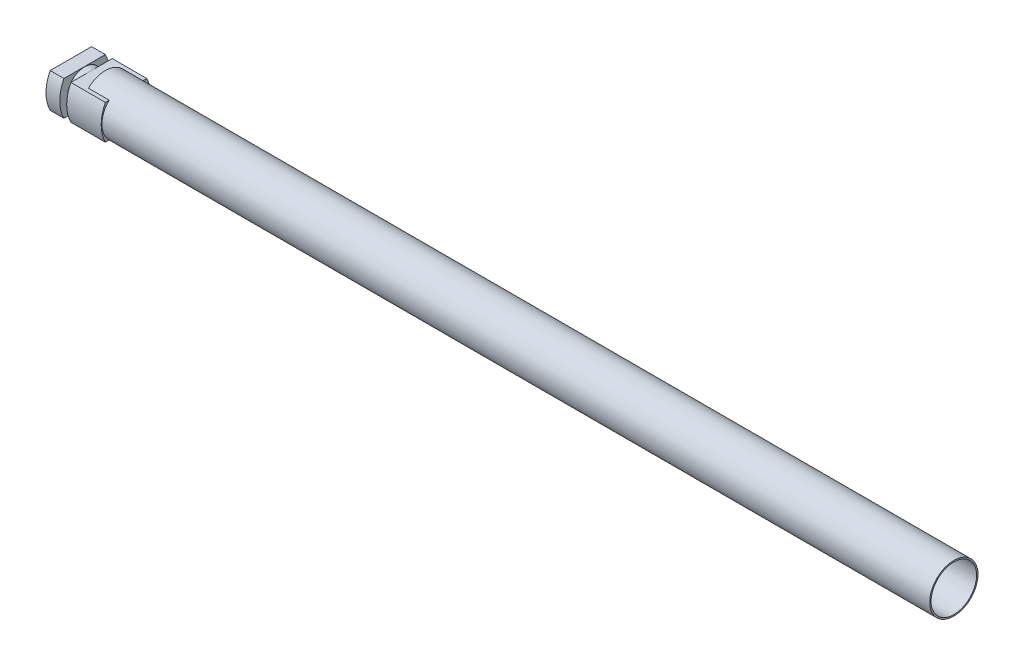
ISO-10303-21;
HEADER;
FILE_DESCRIPTION(('STEP AP214'),'2;1');
FILE_NAME('part.step','',(''),(''),'','','');
FILE_SCHEMA(('AUTOMOTIVE_DESIGN { 1 0 10303 214 1 1 1 1 }'));
ENDSEC;
DATA;
#1=APPLICATION_CONTEXT('core data for automotive mechanical design processes');
#2=APPLICATION_PROTOCOL_DEFINITION('international standard','automotive_design',2000,#1);
#3=PRODUCT_CONTEXT('',#1,'mechanical');
#4=PRODUCT('Part','Part','',(#3));
#5=PRODUCT_RELATED_PRODUCT_CATEGORY('part','',(#4));
#6=PRODUCT_DEFINITION_FORMATION('','',#4);
#7=PRODUCT_DEFINITION_CONTEXT('part definition',#1,'design');
#8=PRODUCT_DEFINITION('design','',#6,#7);
#9=PRODUCT_DEFINITION_SHAPE('','',#8);
#10=(LENGTH_UNIT() NAMED_UNIT(*) SI_UNIT(.MILLI.,.METRE.));
#11=(NAMED_UNIT(*) PLANE_ANGLE_UNIT() SI_UNIT($,.RADIAN.));
#12=(NAMED_UNIT(*) SI_UNIT($,.STERADIAN.) SOLID_ANGLE_UNIT());
#13=UNCERTAINTY_MEASURE_WITH_UNIT(LENGTH_MEASURE(1.E-05),#10,'distance_accuracy_value','');
#14=(GEOMETRIC_REPRESENTATION_CONTEXT(3) GLOBAL_UNCERTAINTY_ASSIGNED_CONTEXT((#13)) GLOBAL_UNIT_ASSIGNED_CONTEXT((#10,
#11,#12)) REPRESENTATION_CONTEXT('',''));
#15=CARTESIAN_POINT('',(0.,0.,0.));
#16=DIRECTION('',(0.,0.,1.));
#17=DIRECTION('',(1.,0.,0.));
#18=AXIS2_PLACEMENT_3D('',#15,#16,#17);
#19=CARTESIAN_POINT('',(101.6,0.,-23.831742394349));
#20=DIRECTION('',(-1.,0.,0.));
#21=DIRECTION('',(0.,0.,1.));
#22=AXIS2_PLACEMENT_3D('',#19,#20,#21);
#23=PLANE('',#22);
#24=DIRECTION('',(0.,0.,1.));
#25=VECTOR('',#24,1.);
#26=CARTESIAN_POINT('',(101.6,31.75,38.1));
#27=LINE('',#26,#25);
#28=CARTESIAN_POINT('',(101.6,31.75,-27.3566372202433));
#29=VERTEX_POINT('',#28);
#30=CARTESIAN_POINT('',(101.6,31.75,27.3566372202433));
#31=VERTEX_POINT('',#30);
#32=EDGE_CURVE('E143',#29,#31,#27,.T.);
#33=ORIENTED_EDGE('',*,*,#32,.T.);
#34=CARTESIAN_POINT('',(101.6,0.,0.));
#35=DIRECTION('',(1.,0.,0.));
#36=DIRECTION('',(0.,0.,-1.));
#37=AXIS2_PLACEMENT_3D('',#34,#35,#36);
#38=CIRCLE('',#37,41.91);
#39=CARTESIAN_POINT('',(101.6,-31.75,27.3566372202433));
#40=VERTEX_POINT('',#39);
#41=EDGE_CURVE('E145',#31,#40,#38,.T.);
#42=ORIENTED_EDGE('',*,*,#41,.T.);
#43=DIRECTION('',(0.,0.,-1.));
#44=VECTOR('',#43,1.);
#45=CARTESIAN_POINT('',(101.6,-31.75,-38.1));
#46=LINE('',#45,#44);
#47=CARTESIAN_POINT('',(101.6,-31.75,-27.3566372202433));
#48=VERTEX_POINT('',#47);
#49=EDGE_CURVE('E219',#40,#48,#46,.T.);
#50=ORIENTED_EDGE('',*,*,#49,.T.);
#51=EDGE_CURVE('E148',#48,#29,#38,.T.);
#52=ORIENTED_EDGE('',*,*,#51,.T.);
#53=EDGE_LOOP('',(#33,#42,#50,#52));
#54=FACE_BOUND('',#53,.T.);
#55=ADVANCED_FACE('F33',(#54),#23,.F.);
#56=CARTESIAN_POINT('',(101.6,0.,0.));
#57=DIRECTION('',(1.,0.,0.));
#58=DIRECTION('',(0.,0.,-1.));
#59=AXIS2_PLACEMENT_3D('',#56,#57,#58);
#60=CIRCLE('',#59,44.45);
#61=CARTESIAN_POINT('',(101.6,31.75,31.1085197333463));
#62=VERTEX_POINT('',#61);
#63=CARTESIAN_POINT('',(101.6,-31.75,31.1085197333463));
#64=VERTEX_POINT('',#63);
#65=EDGE_CURVE('E189',#62,#64,#60,.T.);
#66=ORIENTED_EDGE('',*,*,#65,.F.);
#67=CARTESIAN_POINT('',(101.6,31.75,38.1));
#68=VERTEX_POINT('',#67);
#69=EDGE_CURVE('E151',#62,#68,#27,.T.);
#70=ORIENTED_EDGE('',*,*,#69,.T.);
#71=CARTESIAN_POINT('',(101.6,0.,-23.831742394349));
#72=DIRECTION('',(1.,0.,0.));
#73=DIRECTION('',(0.,0.,1.));
#74=AXIS2_PLACEMENT_3D('',#71,#72,#73);
#75=CIRCLE('',#74,69.596);
#76=CARTESIAN_POINT('',(101.6,-31.75,38.1));
#77=VERTEX_POINT('',#76);
#78=EDGE_CURVE('E210',#68,#77,#75,.T.);
#79=ORIENTED_EDGE('',*,*,#78,.T.);
#80=EDGE_CURVE('E215',#77,#64,#46,.T.);
#81=ORIENTED_EDGE('',*,*,#80,.T.);
#82=EDGE_LOOP('',(#66,#70,#79,#81));
#83=FACE_BOUND('',#82,.T.);
#84=ADVANCED_FACE('F285',(#83),#23,.F.);
#85=CARTESIAN_POINT('',(101.6,0.,-23.831742394349));
#86=DIRECTION('',(-1.,0.,0.));
#87=DIRECTION('',(0.,0.,1.));
#88=AXIS2_PLACEMENT_3D('',#85,#86,#87);
#89=CYLINDRICAL_SURFACE('',#88,69.596);
#90=CARTESIAN_POINT('',(25.4,0.,-23.831742394349));
#91=DIRECTION('',(1.,0.,0.));
#92=DIRECTION('',(0.,0.,-1.));
#93=AXIS2_PLACEMENT_3D('',#90,#91,#92);
#94=CIRCLE('',#93,69.596);
#95=CARTESIAN_POINT('',(25.4,31.75,38.1));
#96=VERTEX_POINT('',#95);
#97=CARTESIAN_POINT('',(25.4,-31.75,38.1));
#98=VERTEX_POINT('',#97);
#99=EDGE_CURVE('E207',#96,#98,#94,.T.);
#100=ORIENTED_EDGE('',*,*,#99,.F.);
#101=DIRECTION('',(-1.,0.,0.));
#102=VECTOR('',#101,1.);
#103=CARTESIAN_POINT('',(101.6,31.75,38.1));
#104=LINE('',#103,#102);
#105=CARTESIAN_POINT('',(0.,31.75,38.1));
#106=VERTEX_POINT('',#105);
#107=EDGE_CURVE('E222',#96,#106,#104,.T.);
#108=ORIENTED_EDGE('',*,*,#107,.T.);
#109=CARTESIAN_POINT('',(0.,0.,-23.831742394349));
#110=DIRECTION('',(1.,0.,0.));
#111=DIRECTION('',(0.,0.,1.));
#112=AXIS2_PLACEMENT_3D('',#109,#110,#111);
#113=CIRCLE('',#112,69.596);
#114=CARTESIAN_POINT('',(0.,-31.75,38.1));
#115=VERTEX_POINT('',#114);
#116=EDGE_CURVE('E209',#106,#115,#113,.T.);
#117=ORIENTED_EDGE('',*,*,#116,.T.);
#118=DIRECTION('',(-1.,0.,0.));
#119=VECTOR('',#118,1.);
#120=CARTESIAN_POINT('',(101.6,-31.75,38.1));
#121=LINE('',#120,#119);
#122=EDGE_CURVE('E244',#98,#115,#121,.T.);
#123=ORIENTED_EDGE('',*,*,#122,.F.);
#124=EDGE_LOOP('',(#100,#108,#117,#123));
#125=FACE_BOUND('',#124,.T.);
#126=ADVANCED_FACE('F35',(#125),#89,.T.);
#127=CARTESIAN_POINT('',(101.6,-31.75,-38.1));
#128=DIRECTION('',(0.,1.,0.));
#129=DIRECTION('',(0.,0.,1.));
#130=AXIS2_PLACEMENT_3D('',#127,#128,#129);
#131=PLANE('',#130);
#132=DIRECTION('',(0.,0.,-1.));
#133=VECTOR('',#132,1.);
#134=CARTESIAN_POINT('',(25.4,-31.75,-38.1));
#135=LINE('',#134,#133);
#136=CARTESIAN_POINT('',(25.4,-31.75,-38.1));
#137=VERTEX_POINT('',#136);
#138=EDGE_CURVE('E205',#98,#137,#135,.T.);
#139=ORIENTED_EDGE('',*,*,#138,.F.);
#140=ORIENTED_EDGE('',*,*,#122,.T.);
#141=DIRECTION('',(0.,0.,-1.));
#142=VECTOR('',#141,1.);
#143=CARTESIAN_POINT('',(0.,-31.75,-38.1));
#144=LINE('',#143,#142);
#145=CARTESIAN_POINT('',(0.,-31.75,-38.1));
#146=VERTEX_POINT('',#145);
#147=EDGE_CURVE('E225',#115,#146,#144,.T.);
#148=ORIENTED_EDGE('',*,*,#147,.T.);
#149=DIRECTION('',(-1.,0.,0.));
#150=VECTOR('',#149,1.);
#151=CARTESIAN_POINT('',(101.6,-31.75,-38.1));
#152=LINE('',#151,#150);
#153=EDGE_CURVE('E240',#137,#146,#152,.T.);
#154=ORIENTED_EDGE('',*,*,#153,.F.);
#155=EDGE_LOOP('',(#139,#140,#148,#154));
#156=FACE_BOUND('',#155,.T.);
#157=ADVANCED_FACE('F270',(#156),#131,.F.);
#158=CARTESIAN_POINT('',(101.6,0.,23.831742394349));
#159=DIRECTION('',(-1.,0.,0.));
#160=DIRECTION('',(0.,0.,1.));
#161=AXIS2_PLACEMENT_3D('',#158,#159,#160);
#162=CYLINDRICAL_SURFACE('',#161,69.596);
#163=CARTESIAN_POINT('',(25.4,0.,23.831742394349));
#164=DIRECTION('',(1.,0.,0.));
#165=DIRECTION('',(0.,0.,-1.));
#166=AXIS2_PLACEMENT_3D('',#163,#164,#165);
#167=CIRCLE('',#166,69.596);
#168=CARTESIAN_POINT('',(25.4,31.75,-38.1));
#169=VERTEX_POINT('',#168);
#170=EDGE_CURVE('E203',#137,#169,#167,.T.);
#171=ORIENTED_EDGE('',*,*,#170,.F.);
#172=ORIENTED_EDGE('',*,*,#153,.T.);
#173=CARTESIAN_POINT('',(0.,0.,23.831742394349));
#174=DIRECTION('',(1.,0.,0.));
#175=DIRECTION('',(0.,0.,1.));
#176=AXIS2_PLACEMENT_3D('',#173,#174,#175);
#177=CIRCLE('',#176,69.596);
#178=CARTESIAN_POINT('',(0.,31.75,-38.1));
#179=VERTEX_POINT('',#178);
#180=EDGE_CURVE('E228',#146,#179,#177,.T.);
#181=ORIENTED_EDGE('',*,*,#180,.T.);
#182=DIRECTION('',(-1.,0.,0.));
#183=VECTOR('',#182,1.);
#184=CARTESIAN_POINT('',(101.6,31.75,-38.1));
#185=LINE('',#184,#183);
#186=EDGE_CURVE('E236',#169,#179,#185,.T.);
#187=ORIENTED_EDGE('',*,*,#186,.F.);
#188=EDGE_LOOP('',(#171,#172,#181,#187));
#189=FACE_BOUND('',#188,.T.);
#190=ADVANCED_FACE('F272',(#189),#162,.T.);
#191=CARTESIAN_POINT('',(101.6,31.75,38.1));
#192=DIRECTION('',(0.,-1.,0.));
#193=DIRECTION('',(0.,0.,-1.));
#194=AXIS2_PLACEMENT_3D('',#191,#192,#193);
#195=PLANE('',#194);
#196=DIRECTION('',(0.,0.,1.));
#197=VECTOR('',#196,1.);
#198=CARTESIAN_POINT('',(25.4,31.75,38.1));
#199=LINE('',#198,#197);
#200=EDGE_CURVE('E249',#169,#96,#199,.T.);
#201=ORIENTED_EDGE('',*,*,#200,.F.);
#202=ORIENTED_EDGE('',*,*,#186,.T.);
#203=DIRECTION('',(0.,0.,1.));
#204=VECTOR('',#203,1.);
#205=CARTESIAN_POINT('',(0.,31.75,38.1));
#206=LINE('',#205,#204);
#207=EDGE_CURVE('E214',#179,#106,#206,.T.);
#208=ORIENTED_EDGE('',*,*,#207,.T.);
#209=ORIENTED_EDGE('',*,*,#107,.F.);
#210=EDGE_LOOP('',(#201,#202,#208,#209));
#211=FACE_BOUND('',#210,.T.);
#212=ADVANCED_FACE('F261',(#211),#195,.F.);
#213=CARTESIAN_POINT('',(0.,0.,-23.831742394349));
#214=DIRECTION('',(-1.,0.,0.));
#215=DIRECTION('',(0.,0.,1.));
#216=AXIS2_PLACEMENT_3D('',#213,#214,#215);
#217=PLANE('',#216);
#218=ORIENTED_EDGE('',*,*,#116,.F.);
#219=ORIENTED_EDGE('',*,*,#207,.F.);
#220=ORIENTED_EDGE('',*,*,#180,.F.);
#221=ORIENTED_EDGE('',*,*,#147,.F.);
#222=EDGE_LOOP('',(#218,#219,#220,#221));
#223=FACE_BOUND('',#222,.T.);
#224=ADVANCED_FACE('F267',(#223),#217,.T.);
#225=CARTESIAN_POINT('',(25.4,31.334385241102,0.));
#226=DIRECTION('',(1.,0.,0.));
#227=DIRECTION('',(0.,0.,-1.));
#228=AXIS2_PLACEMENT_3D('',#225,#226,#227);
#229=PLANE('',#228);
#230=CARTESIAN_POINT('',(25.4,0.,0.));
#231=DIRECTION('',(-1.,0.,0.));
#232=DIRECTION('',(0.,0.,1.));
#233=AXIS2_PLACEMENT_3D('',#230,#231,#232);
#234=CIRCLE('',#233,31.334385241102);
#235=CARTESIAN_POINT('',(25.4,0.,31.334385241102));
#236=VERTEX_POINT('',#235);
#237=EDGE_CURVE('E188',#236,#236,#234,.T.);
#238=ORIENTED_EDGE('',*,*,#237,.T.);
#239=EDGE_LOOP('',(#238));
#240=FACE_BOUND('',#239,.T.);
#241=ORIENTED_EDGE('',*,*,#99,.T.);
#242=ORIENTED_EDGE('',*,*,#138,.T.);
#243=ORIENTED_EDGE('',*,*,#170,.T.);
#244=ORIENTED_EDGE('',*,*,#200,.T.);
#245=EDGE_LOOP('',(#241,#242,#243,#244));
#246=FACE_BOUND('',#245,.T.);
#247=ADVANCED_FACE('F253',(#240,#246),#229,.T.);
#248=CARTESIAN_POINT('',(38.1,31.334385241102,0.));
#249=DIRECTION('',(-1.,0.,0.));
#250=DIRECTION('',(0.,0.,1.));
#251=AXIS2_PLACEMENT_3D('',#248,#249,#250);
#252=PLANE('',#251);
#253=CARTESIAN_POINT('',(38.1,0.,0.));
#254=DIRECTION('',(-1.,0.,0.));
#255=DIRECTION('',(0.,0.,1.));
#256=AXIS2_PLACEMENT_3D('',#253,#254,#255);
#257=CIRCLE('',#256,31.334385241102);
#258=CARTESIAN_POINT('',(38.1,0.,31.334385241102));
#259=VERTEX_POINT('',#258);
#260=EDGE_CURVE('E194',#259,#259,#257,.T.);
#261=ORIENTED_EDGE('',*,*,#260,.F.);
#262=EDGE_LOOP('',(#261));
#263=FACE_BOUND('',#262,.T.);
#264=CARTESIAN_POINT('',(38.1,0.,-23.831742394349));
#265=DIRECTION('',(-1.,0.,0.));
#266=DIRECTION('',(0.,0.,1.));
#267=AXIS2_PLACEMENT_3D('',#264,#265,#266);
#268=CIRCLE('',#267,69.596);
#269=CARTESIAN_POINT('',(38.1,-31.75,38.1));
#270=VERTEX_POINT('',#269);
#271=CARTESIAN_POINT('',(38.1,31.75,38.1));
#272=VERTEX_POINT('',#271);
#273=EDGE_CURVE('E201',#270,#272,#268,.T.);
#274=ORIENTED_EDGE('',*,*,#273,.T.);
#275=DIRECTION('',(0.,0.,-1.));
#276=VECTOR('',#275,1.);
#277=CARTESIAN_POINT('',(38.1,31.75,38.1));
#278=LINE('',#277,#276);
#279=CARTESIAN_POINT('',(38.1,31.75,-38.1));
#280=VERTEX_POINT('',#279);
#281=EDGE_CURVE('E248',#272,#280,#278,.T.);
#282=ORIENTED_EDGE('',*,*,#281,.T.);
#283=CARTESIAN_POINT('',(38.1,0.,23.831742394349));
#284=DIRECTION('',(-1.,0.,0.));
#285=DIRECTION('',(0.,0.,1.));
#286=AXIS2_PLACEMENT_3D('',#283,#284,#285);
#287=CIRCLE('',#286,69.596);
#288=CARTESIAN_POINT('',(38.1,-31.75,-38.1));
#289=VERTEX_POINT('',#288);
#290=EDGE_CURVE('E197',#280,#289,#287,.T.);
#291=ORIENTED_EDGE('',*,*,#290,.T.);
#292=DIRECTION('',(0.,0.,1.));
#293=VECTOR('',#292,1.);
#294=CARTESIAN_POINT('',(38.1,-31.75,-38.1));
#295=LINE('',#294,#293);
#296=EDGE_CURVE('E199',#289,#270,#295,.T.);
#297=ORIENTED_EDGE('',*,*,#296,.T.);
#298=EDGE_LOOP('',(#274,#282,#291,#297));
#299=FACE_BOUND('',#298,.T.);
#300=ADVANCED_FACE('F301',(#263,#299),#252,.T.);
#301=CARTESIAN_POINT('',(-7.21898536810811,0.,0.));
#302=DIRECTION('',(-1.,0.,0.));
#303=DIRECTION('',(0.,0.,1.));
#304=AXIS2_PLACEMENT_3D('',#301,#302,#303);
#305=CYLINDRICAL_SURFACE('',#304,31.334385241102);
#306=ORIENTED_EDGE('',*,*,#260,.T.);
#307=EDGE_LOOP('',(#306));
#308=FACE_BOUND('',#307,.T.);
#309=ORIENTED_EDGE('',*,*,#237,.F.);
#310=EDGE_LOOP('',(#309));
#311=FACE_BOUND('',#310,.T.);
#312=ADVANCED_FACE('F295',(#308,#311),#305,.T.);
#313=CARTESIAN_POINT('',(101.6,-31.75,-31.1085197333463));
#314=VERTEX_POINT('',#313);
#315=CARTESIAN_POINT('',(101.6,31.75,-31.1085197333463));
#316=VERTEX_POINT('',#315);
#317=EDGE_CURVE('E162',#314,#316,#60,.T.);
#318=ORIENTED_EDGE('',*,*,#317,.F.);
#319=CARTESIAN_POINT('',(101.6,-31.75,-38.1));
#320=VERTEX_POINT('',#319);
#321=EDGE_CURVE('E213',#314,#320,#46,.T.);
#322=ORIENTED_EDGE('',*,*,#321,.T.);
#323=CARTESIAN_POINT('',(101.6,0.,23.831742394349));
#324=DIRECTION('',(1.,0.,0.));
#325=DIRECTION('',(0.,0.,1.));
#326=AXIS2_PLACEMENT_3D('',#323,#324,#325);
#327=CIRCLE('',#326,69.596);
#328=CARTESIAN_POINT('',(101.6,31.75,-38.1));
#329=VERTEX_POINT('',#328);
#330=EDGE_CURVE('E218',#320,#329,#327,.T.);
#331=ORIENTED_EDGE('',*,*,#330,.T.);
#332=EDGE_CURVE('E150',#329,#316,#27,.T.);
#333=ORIENTED_EDGE('',*,*,#332,.T.);
#334=EDGE_LOOP('',(#318,#322,#331,#333));
#335=FACE_BOUND('',#334,.T.);
#336=ADVANCED_FACE('F287',(#335),#23,.F.);
#337=DIRECTION('',(0.,0.,1.));
#338=VECTOR('',#337,1.);
#339=CARTESIAN_POINT('',(63.5,31.75,38.1));
#340=LINE('',#339,#338);
#341=CARTESIAN_POINT('',(63.5,31.75,-31.1085197333463));
#342=VERTEX_POINT('',#341);
#343=CARTESIAN_POINT('',(63.5,31.75,-27.3566372202433));
#344=VERTEX_POINT('',#343);
#345=EDGE_CURVE('E48',#342,#344,#340,.T.);
#346=ORIENTED_EDGE('',*,*,#345,.F.);
#347=DIRECTION('',(1.,0.,0.));
#348=VECTOR('',#347,1.);
#349=CARTESIAN_POINT('',(63.5,31.75,-31.1085197333463));
#350=LINE('',#349,#348);
#351=EDGE_CURVE('E179',#342,#316,#350,.T.);
#352=ORIENTED_EDGE('',*,*,#351,.T.);
#353=ORIENTED_EDGE('',*,*,#332,.F.);
#354=EDGE_CURVE('E237',#329,#280,#185,.T.);
#355=ORIENTED_EDGE('',*,*,#354,.T.);
#356=ORIENTED_EDGE('',*,*,#281,.F.);
#357=EDGE_CURVE('E233',#68,#272,#104,.T.);
#358=ORIENTED_EDGE('',*,*,#357,.F.);
#359=ORIENTED_EDGE('',*,*,#69,.F.);
#360=DIRECTION('',(1.,0.,0.));
#361=VECTOR('',#360,1.);
#362=CARTESIAN_POINT('',(63.5,31.75,31.1085197333463));
#363=LINE('',#362,#361);
#364=CARTESIAN_POINT('',(63.5,31.75,31.1085197333463));
#365=VERTEX_POINT('',#364);
#366=EDGE_CURVE('E177',#62,#365,#363,.F.);
#367=ORIENTED_EDGE('',*,*,#366,.T.);
#368=CARTESIAN_POINT('',(63.5,31.75,27.3566372202433));
#369=VERTEX_POINT('',#368);
#370=EDGE_CURVE('E166',#369,#365,#340,.T.);
#371=ORIENTED_EDGE('',*,*,#370,.F.);
#372=DIRECTION('',(1.,0.,0.));
#373=VECTOR('',#372,1.);
#374=CARTESIAN_POINT('',(63.5,31.75,27.3566372202433));
#375=LINE('',#374,#373);
#376=EDGE_CURVE('E158',#31,#369,#375,.F.);
#377=ORIENTED_EDGE('',*,*,#376,.F.);
#378=ORIENTED_EDGE('',*,*,#32,.F.);
#379=DIRECTION('',(1.,0.,0.));
#380=VECTOR('',#379,1.);
#381=CARTESIAN_POINT('',(63.5,31.75,-27.3566372202433));
#382=LINE('',#381,#380);
#383=EDGE_CURVE('E53',#344,#29,#382,.T.);
#384=ORIENTED_EDGE('',*,*,#383,.F.);
#385=EDGE_LOOP('',(#346,#352,#353,#355,#356,#358,#359,#367,#371,#377,#378,#384));
#386=FACE_BOUND('',#385,.T.);
#387=ADVANCED_FACE('F164',(#386),#195,.F.);
#388=ORIENTED_EDGE('',*,*,#290,.F.);
#389=ORIENTED_EDGE('',*,*,#354,.F.);
#390=ORIENTED_EDGE('',*,*,#330,.F.);
#391=EDGE_CURVE('E241',#320,#289,#152,.T.);
#392=ORIENTED_EDGE('',*,*,#391,.T.);
#393=EDGE_LOOP('',(#388,#389,#390,#392));
#394=FACE_BOUND('',#393,.T.);
#395=ADVANCED_FACE('F275',(#394),#162,.T.);
#396=DIRECTION('',(0.,0.,-1.));
#397=VECTOR('',#396,1.);
#398=CARTESIAN_POINT('',(63.5,-31.75,-38.1));
#399=LINE('',#398,#397);
#400=CARTESIAN_POINT('',(63.5,-31.75,31.1085197333463));
#401=VERTEX_POINT('',#400);
#402=CARTESIAN_POINT('',(63.5,-31.75,27.3566372202433));
#403=VERTEX_POINT('',#402);
#404=EDGE_CURVE('E11',#401,#403,#399,.T.);
#405=ORIENTED_EDGE('',*,*,#404,.F.);
#406=DIRECTION('',(1.,0.,0.));
#407=VECTOR('',#406,1.);
#408=CARTESIAN_POINT('',(63.5,-31.75,31.1085197333463));
#409=LINE('',#408,#407);
#410=EDGE_CURVE('E175',#401,#64,#409,.T.);
#411=ORIENTED_EDGE('',*,*,#410,.T.);
#412=ORIENTED_EDGE('',*,*,#80,.F.);
#413=EDGE_CURVE('E245',#77,#270,#121,.T.);
#414=ORIENTED_EDGE('',*,*,#413,.T.);
#415=ORIENTED_EDGE('',*,*,#296,.F.);
#416=ORIENTED_EDGE('',*,*,#391,.F.);
#417=ORIENTED_EDGE('',*,*,#321,.F.);
#418=DIRECTION('',(1.,0.,0.));
#419=VECTOR('',#418,1.);
#420=CARTESIAN_POINT('',(63.5,-31.75,-31.1085197333463));
#421=LINE('',#420,#419);
#422=CARTESIAN_POINT('',(63.5,-31.75,-31.1085197333463));
#423=VERTEX_POINT('',#422);
#424=EDGE_CURVE('E168',#314,#423,#421,.F.);
#425=ORIENTED_EDGE('',*,*,#424,.T.);
#426=CARTESIAN_POINT('',(63.5,-31.75,-27.3566372202433));
#427=VERTEX_POINT('',#426);
#428=EDGE_CURVE('E37',#427,#423,#399,.T.);
#429=ORIENTED_EDGE('',*,*,#428,.F.);
#430=DIRECTION('',(1.,0.,0.));
#431=VECTOR('',#430,1.);
#432=CARTESIAN_POINT('',(63.5,-31.75,-27.3566372202433));
#433=LINE('',#432,#431);
#434=EDGE_CURVE('E170',#48,#427,#433,.F.);
#435=ORIENTED_EDGE('',*,*,#434,.F.);
#436=ORIENTED_EDGE('',*,*,#49,.F.);
#437=DIRECTION('',(1.,0.,0.));
#438=VECTOR('',#437,1.);
#439=CARTESIAN_POINT('',(63.5,-31.75,27.3566372202433));
#440=LINE('',#439,#438);
#441=EDGE_CURVE('E161',#403,#40,#440,.T.);
#442=ORIENTED_EDGE('',*,*,#441,.F.);
#443=EDGE_LOOP('',(#405,#411,#412,#414,#415,#416,#417,#425,#429,#435,#436,#442));
#444=FACE_BOUND('',#443,.T.);
#445=ADVANCED_FACE('F281',(#444),#131,.F.);
#446=ORIENTED_EDGE('',*,*,#273,.F.);
#447=ORIENTED_EDGE('',*,*,#413,.F.);
#448=ORIENTED_EDGE('',*,*,#78,.F.);
#449=ORIENTED_EDGE('',*,*,#357,.T.);
#450=EDGE_LOOP('',(#446,#447,#448,#449));
#451=FACE_BOUND('',#450,.T.);
#452=ADVANCED_FACE('F337',(#451),#89,.T.);
#453=CARTESIAN_POINT('',(1625.6,0.,0.));
#454=DIRECTION('',(1.,0.,0.));
#455=DIRECTION('',(0.,0.,-1.));
#456=AXIS2_PLACEMENT_3D('',#453,#454,#455);
#457=PLANE('',#456);
#458=CARTESIAN_POINT('',(1625.6,0.,0.));
#459=DIRECTION('',(1.,0.,0.));
#460=DIRECTION('',(0.,0.,-1.));
#461=AXIS2_PLACEMENT_3D('',#458,#459,#460);
#462=CIRCLE('',#461,44.45);
#463=CARTESIAN_POINT('',(1625.6,0.,-44.45));
#464=VERTEX_POINT('',#463);
#465=EDGE_CURVE('E184',#464,#464,#462,.T.);
#466=ORIENTED_EDGE('',*,*,#465,.T.);
#467=EDGE_LOOP('',(#466));
#468=FACE_BOUND('',#467,.T.);
#469=CARTESIAN_POINT('',(1625.6,0.,0.));
#470=DIRECTION('',(1.,0.,0.));
#471=DIRECTION('',(0.,0.,-1.));
#472=AXIS2_PLACEMENT_3D('',#469,#470,#471);
#473=CIRCLE('',#472,41.91);
#474=CARTESIAN_POINT('',(1625.6,0.,-41.91));
#475=VERTEX_POINT('',#474);
#476=EDGE_CURVE('E182',#475,#475,#473,.T.);
#477=ORIENTED_EDGE('',*,*,#476,.F.);
#478=EDGE_LOOP('',(#477));
#479=FACE_BOUND('',#478,.T.);
#480=ADVANCED_FACE('F354',(#468,#479),#457,.T.);
#481=CARTESIAN_POINT('',(1625.6,0.,0.));
#482=DIRECTION('',(-1.,0.,0.));
#483=DIRECTION('',(0.,0.,1.));
#484=AXIS2_PLACEMENT_3D('',#481,#482,#483);
#485=CYLINDRICAL_SURFACE('',#484,44.45);
#486=ORIENTED_EDGE('',*,*,#465,.F.);
#487=EDGE_LOOP('',(#486));
#488=FACE_BOUND('',#487,.T.);
#489=ORIENTED_EDGE('',*,*,#317,.T.);
#490=ORIENTED_EDGE('',*,*,#351,.F.);
#491=CARTESIAN_POINT('',(63.5,0.,0.));
#492=DIRECTION('',(1.,0.,0.));
#493=DIRECTION('',(0.,0.,-1.));
#494=AXIS2_PLACEMENT_3D('',#491,#492,#493);
#495=CIRCLE('',#494,44.45);
#496=EDGE_CURVE('E320',#342,#365,#495,.T.);
#497=ORIENTED_EDGE('',*,*,#496,.T.);
#498=ORIENTED_EDGE('',*,*,#366,.F.);
#499=ORIENTED_EDGE('',*,*,#65,.T.);
#500=ORIENTED_EDGE('',*,*,#410,.F.);
#501=EDGE_CURVE('E318',#401,#423,#495,.T.);
#502=ORIENTED_EDGE('',*,*,#501,.T.);
#503=ORIENTED_EDGE('',*,*,#424,.F.);
#504=EDGE_LOOP('',(#489,#490,#497,#498,#499,#500,#502,#503));
#505=FACE_BOUND('',#504,.T.);
#506=ADVANCED_FACE('F315',(#488,#505),#485,.T.);
#507=CARTESIAN_POINT('',(1625.6,0.,0.));
#508=DIRECTION('',(-1.,0.,0.));
#509=DIRECTION('',(0.,0.,1.));
#510=AXIS2_PLACEMENT_3D('',#507,#508,#509);
#511=CYLINDRICAL_SURFACE('',#510,41.91);
#512=ORIENTED_EDGE('',*,*,#476,.T.);
#513=EDGE_LOOP('',(#512));
#514=FACE_BOUND('',#513,.T.);
#515=ORIENTED_EDGE('',*,*,#41,.F.);
#516=ORIENTED_EDGE('',*,*,#376,.T.);
#517=CARTESIAN_POINT('',(63.5,0.,0.));
#518=DIRECTION('',(1.,0.,0.));
#519=DIRECTION('',(0.,0.,-1.));
#520=AXIS2_PLACEMENT_3D('',#517,#518,#519);
#521=CIRCLE('',#520,41.91);
#522=EDGE_CURVE('E321',#344,#369,#521,.T.);
#523=ORIENTED_EDGE('',*,*,#522,.F.);
#524=ORIENTED_EDGE('',*,*,#383,.T.);
#525=ORIENTED_EDGE('',*,*,#51,.F.);
#526=ORIENTED_EDGE('',*,*,#434,.T.);
#527=EDGE_CURVE('E324',#403,#427,#521,.T.);
#528=ORIENTED_EDGE('',*,*,#527,.F.);
#529=ORIENTED_EDGE('',*,*,#441,.T.);
#530=EDGE_LOOP('',(#515,#516,#523,#524,#525,#526,#528,#529));
#531=FACE_BOUND('',#530,.T.);
#532=ADVANCED_FACE('F156',(#514,#531),#511,.F.);
#533=CARTESIAN_POINT('',(63.5,0.,0.));
#534=DIRECTION('',(1.,0.,0.));
#535=DIRECTION('',(0.,0.,-1.));
#536=AXIS2_PLACEMENT_3D('',#533,#534,#535);
#537=PLANE('',#536);
#538=ORIENTED_EDGE('',*,*,#501,.F.);
#539=ORIENTED_EDGE('',*,*,#404,.T.);
#540=ORIENTED_EDGE('',*,*,#527,.T.);
#541=ORIENTED_EDGE('',*,*,#428,.T.);
#542=EDGE_LOOP('',(#538,#539,#540,#541));
#543=FACE_BOUND('',#542,.T.);
#544=ADVANCED_FACE('F329',(#543),#537,.F.);
#545=ORIENTED_EDGE('',*,*,#496,.F.);
#546=ORIENTED_EDGE('',*,*,#345,.T.);
#547=ORIENTED_EDGE('',*,*,#522,.T.);
#548=ORIENTED_EDGE('',*,*,#370,.T.);
#549=EDGE_LOOP('',(#545,#546,#547,#548));
#550=FACE_BOUND('',#549,.T.);
#551=ADVANCED_FACE('F344',(#550),#537,.F.);
#552=CLOSED_SHELL('',(#55,#84,#126,#157,#190,#212,#224,#247,#300,#312,#336,#387,#395,#445,#452,
#480,#506,#532,#544,#551));
#553=MANIFOLD_SOLID_BREP('B2',#552);
#554=ADVANCED_BREP_SHAPE_REPRESENTATION('',(#18,#553),#14);
#555=SHAPE_DEFINITION_REPRESENTATION(#9,#554);
ENDSEC;
END-ISO-10303-21;
